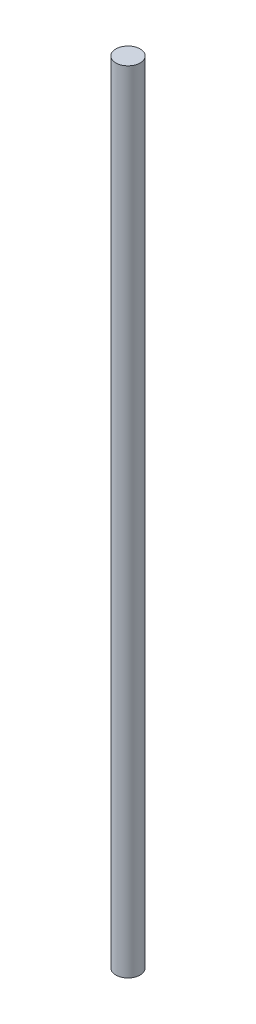
ISO-10303-21;
HEADER;
FILE_DESCRIPTION(('STEP AP214'),'2;1');
FILE_NAME('part.step','',(''),(''),'','','');
FILE_SCHEMA(('AUTOMOTIVE_DESIGN { 1 0 10303 214 1 1 1 1 }'));
ENDSEC;
DATA;
#1=APPLICATION_CONTEXT('core data for automotive mechanical design processes');
#2=APPLICATION_PROTOCOL_DEFINITION('international standard','automotive_design',2000,#1);
#3=PRODUCT_CONTEXT('',#1,'mechanical');
#4=PRODUCT('Part','Part','',(#3));
#5=PRODUCT_RELATED_PRODUCT_CATEGORY('part','',(#4));
#6=PRODUCT_DEFINITION_FORMATION('','',#4);
#7=PRODUCT_DEFINITION_CONTEXT('part definition',#1,'design');
#8=PRODUCT_DEFINITION('design','',#6,#7);
#9=PRODUCT_DEFINITION_SHAPE('','',#8);
#10=(LENGTH_UNIT() NAMED_UNIT(*) SI_UNIT(.MILLI.,.METRE.));
#11=(NAMED_UNIT(*) PLANE_ANGLE_UNIT() SI_UNIT($,.RADIAN.));
#12=(NAMED_UNIT(*) SI_UNIT($,.STERADIAN.) SOLID_ANGLE_UNIT());
#13=UNCERTAINTY_MEASURE_WITH_UNIT(LENGTH_MEASURE(1.E-05),#10,'distance_accuracy_value','');
#14=(GEOMETRIC_REPRESENTATION_CONTEXT(3) GLOBAL_UNCERTAINTY_ASSIGNED_CONTEXT((#13)) GLOBAL_UNIT_ASSIGNED_CONTEXT((#10,
#11,#12)) REPRESENTATION_CONTEXT('',''));
#15=CARTESIAN_POINT('',(0.,0.,0.));
#16=DIRECTION('',(0.,0.,1.));
#17=DIRECTION('',(1.,0.,0.));
#18=AXIS2_PLACEMENT_3D('',#15,#16,#17);
#19=CARTESIAN_POINT('',(0.,260.,0.));
#20=DIRECTION('',(0.,-1.,0.));
#21=DIRECTION('',(0.,0.,-1.));
#22=AXIS2_PLACEMENT_3D('',#19,#20,#21);
#23=CYLINDRICAL_SURFACE('',#22,4.);
#24=CARTESIAN_POINT('',(0.,260.,0.));
#25=DIRECTION('',(0.,1.,0.));
#26=DIRECTION('',(0.,0.,1.));
#27=AXIS2_PLACEMENT_3D('',#24,#25,#26);
#28=CIRCLE('',#27,4.);
#29=CARTESIAN_POINT('',(0.,260.,4.));
#30=VERTEX_POINT('',#29);
#31=EDGE_CURVE('E10',#30,#30,#28,.T.);
#32=ORIENTED_EDGE('',*,*,#31,.F.);
#33=EDGE_LOOP('',(#32));
#34=FACE_BOUND('',#33,.T.);
#35=CARTESIAN_POINT('',(0.,0.,0.));
#36=DIRECTION('',(0.,1.,0.));
#37=DIRECTION('',(0.,0.,1.));
#38=AXIS2_PLACEMENT_3D('',#35,#36,#37);
#39=CIRCLE('',#38,4.);
#40=CARTESIAN_POINT('',(0.,0.,4.));
#41=VERTEX_POINT('',#40);
#42=EDGE_CURVE('E33',#41,#41,#39,.T.);
#43=ORIENTED_EDGE('',*,*,#42,.T.);
#44=EDGE_LOOP('',(#43));
#45=FACE_BOUND('',#44,.T.);
#46=ADVANCED_FACE('F30',(#34,#45),#23,.T.);
#47=CARTESIAN_POINT('',(0.,260.,0.));
#48=DIRECTION('',(0.,1.,0.));
#49=DIRECTION('',(0.,0.,1.));
#50=AXIS2_PLACEMENT_3D('',#47,#48,#49);
#51=PLANE('',#50);
#52=ORIENTED_EDGE('',*,*,#31,.T.);
#53=EDGE_LOOP('',(#52));
#54=FACE_BOUND('',#53,.T.);
#55=ADVANCED_FACE('F45',(#54),#51,.T.);
#56=CARTESIAN_POINT('',(0.,0.,0.));
#57=DIRECTION('',(0.,1.,0.));
#58=DIRECTION('',(0.,0.,1.));
#59=AXIS2_PLACEMENT_3D('',#56,#57,#58);
#60=PLANE('',#59);
#61=ORIENTED_EDGE('',*,*,#42,.F.);
#62=EDGE_LOOP('',(#61));
#63=FACE_BOUND('',#62,.T.);
#64=ADVANCED_FACE('F43',(#63),#60,.F.);
#65=CLOSED_SHELL('',(#46,#55,#64));
#66=MANIFOLD_SOLID_BREP('B2',#65);
#67=ADVANCED_BREP_SHAPE_REPRESENTATION('',(#18,#66),#14);
#68=SHAPE_DEFINITION_REPRESENTATION(#9,#67);
ENDSEC;
END-ISO-10303-21;
